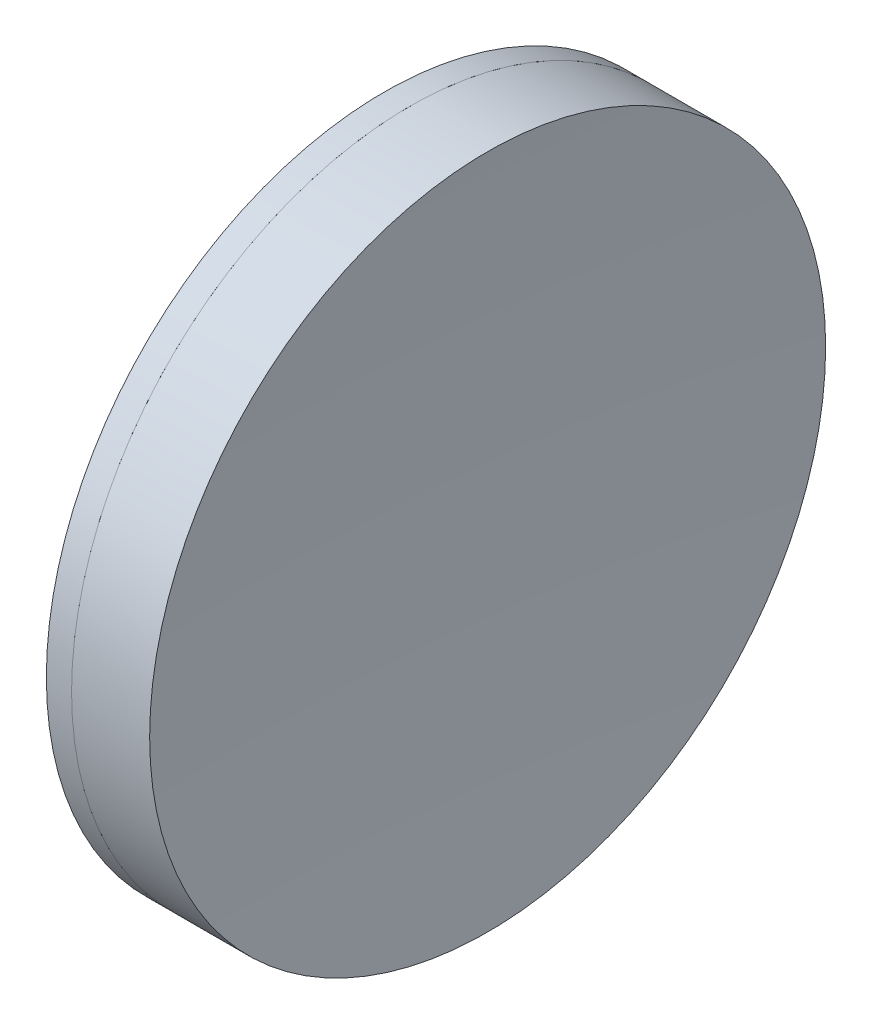
ISO-10303-21;
HEADER;
FILE_DESCRIPTION(('STEP AP214'),'2;1');
FILE_NAME('part.step','',(''),(''),'','','');
FILE_SCHEMA(('AUTOMOTIVE_DESIGN { 1 0 10303 214 1 1 1 1 }'));
ENDSEC;
DATA;
#1=APPLICATION_CONTEXT('core data for automotive mechanical design processes');
#2=APPLICATION_PROTOCOL_DEFINITION('international standard','automotive_design',2000,#1);
#3=PRODUCT_CONTEXT('',#1,'mechanical');
#4=PRODUCT('Part','Part','',(#3));
#5=PRODUCT_RELATED_PRODUCT_CATEGORY('part','',(#4));
#6=PRODUCT_DEFINITION_FORMATION('','',#4);
#7=PRODUCT_DEFINITION_CONTEXT('part definition',#1,'design');
#8=PRODUCT_DEFINITION('design','',#6,#7);
#9=PRODUCT_DEFINITION_SHAPE('','',#8);
#10=(LENGTH_UNIT() NAMED_UNIT(*) SI_UNIT(.MILLI.,.METRE.));
#11=(NAMED_UNIT(*) PLANE_ANGLE_UNIT() SI_UNIT($,.RADIAN.));
#12=(NAMED_UNIT(*) SI_UNIT($,.STERADIAN.) SOLID_ANGLE_UNIT());
#13=UNCERTAINTY_MEASURE_WITH_UNIT(LENGTH_MEASURE(1.E-05),#10,'distance_accuracy_value','');
#14=(GEOMETRIC_REPRESENTATION_CONTEXT(3) GLOBAL_UNCERTAINTY_ASSIGNED_CONTEXT((#13)) GLOBAL_UNIT_ASSIGNED_CONTEXT((#10,
#11,#12)) REPRESENTATION_CONTEXT('',''));
#15=CARTESIAN_POINT('',(0.,0.,0.));
#16=DIRECTION('',(0.,0.,1.));
#17=DIRECTION('',(1.,0.,0.));
#18=AXIS2_PLACEMENT_3D('',#15,#16,#17);
#19=CARTESIAN_POINT('',(44.3647689612468,0.,0.));
#20=DIRECTION('',(-1.,0.,0.));
#21=DIRECTION('',(0.,0.,-1.));
#22=AXIS2_PLACEMENT_3D('',#19,#20,#21);
#23=SPHERICAL_SURFACE('',#22,161.5);
#24=CARTESIAN_POINT('',(203.854862697504,0.,0.));
#25=DIRECTION('',(-1.,0.,0.));
#26=DIRECTION('',(0.,0.,1.));
#27=AXIS2_PLACEMENT_3D('',#24,#25,#26);
#28=CIRCLE('',#27,25.4);
#29=CARTESIAN_POINT('',(203.854862697504,0.,25.4));
#30=VERTEX_POINT('',#29);
#31=EDGE_CURVE('E51',#30,#30,#28,.T.);
#32=ORIENTED_EDGE('',*,*,#31,.T.);
#33=EDGE_LOOP('',(#32));
#34=FACE_BOUND('',#33,.T.);
#35=ADVANCED_FACE('F45',(#34),#23,.F.);
#36=CARTESIAN_POINT('',(585.114768961247,0.,0.));
#37=DIRECTION('',(-1.,0.,0.));
#38=DIRECTION('',(0.,0.,-1.));
#39=AXIS2_PLACEMENT_3D('',#36,#37,#38);
#40=SPHERICAL_SURFACE('',#39,376.25);
#41=CARTESIAN_POINT('',(209.723103497028,0.,0.));
#42=DIRECTION('',(-1.,0.,0.));
#43=DIRECTION('',(0.,0.,1.));
#44=AXIS2_PLACEMENT_3D('',#41,#42,#43);
#45=CIRCLE('',#44,25.4);
#46=CARTESIAN_POINT('',(209.723103497028,0.,25.4));
#47=VERTEX_POINT('',#46);
#48=EDGE_CURVE('E11',#47,#47,#45,.T.);
#49=ORIENTED_EDGE('',*,*,#48,.F.);
#50=EDGE_LOOP('',(#49));
#51=FACE_BOUND('',#50,.T.);
#52=ADVANCED_FACE('F60',(#51),#40,.F.);
#53=CARTESIAN_POINT('',(-0.551919992657797,0.,0.));
#54=DIRECTION('',(-1.,0.,0.));
#55=DIRECTION('',(0.,0.,1.));
#56=AXIS2_PLACEMENT_3D('',#53,#54,#55);
#57=CYLINDRICAL_SURFACE('',#56,25.4);
#58=ORIENTED_EDGE('',*,*,#48,.T.);
#59=EDGE_LOOP('',(#58));
#60=FACE_BOUND('',#59,.T.);
#61=ORIENTED_EDGE('',*,*,#31,.F.);
#62=EDGE_LOOP('',(#61));
#63=FACE_BOUND('',#62,.T.);
#64=ADVANCED_FACE('F58',(#60,#63),#57,.T.);
#65=CLOSED_SHELL('',(#35,#52,#64));
#66=MANIFOLD_SOLID_BREP('B2',#65);
#67=CARTESIAN_POINT('',(324.964768961247,0.,0.));
#68=DIRECTION('',(-1.,0.,0.));
#69=DIRECTION('',(0.,0.,-1.));
#70=AXIS2_PLACEMENT_3D('',#67,#68,#69);
#71=SPHERICAL_SURFACE('',#70,125.6);
#72=CARTESIAN_POINT('',(201.959891009192,0.,0.));
#73=DIRECTION('',(-1.,0.,0.));
#74=DIRECTION('',(0.,0.,1.));
#75=AXIS2_PLACEMENT_3D('',#72,#73,#74);
#76=CIRCLE('',#75,25.4);
#77=CARTESIAN_POINT('',(201.959891009192,0.,25.4));
#78=VERTEX_POINT('',#77);
#79=EDGE_CURVE('E44',#78,#78,#76,.T.);
#80=ORIENTED_EDGE('',*,*,#79,.T.);
#81=EDGE_LOOP('',(#80));
#82=FACE_BOUND('',#81,.T.);
#83=ADVANCED_FACE('F86',(#82),#71,.T.);
#84=CARTESIAN_POINT('',(-0.816062176165804,0.,0.));
#85=DIRECTION('',(-1.,0.,0.));
#86=DIRECTION('',(0.,0.,1.));
#87=AXIS2_PLACEMENT_3D('',#84,#85,#86);
#88=CYLINDRICAL_SURFACE('',#87,25.4);
#89=CARTESIAN_POINT('',(203.854862697504,0.,0.));
#90=DIRECTION('',(-1.,0.,0.));
#91=DIRECTION('',(0.,0.,1.));
#92=AXIS2_PLACEMENT_3D('',#89,#90,#91);
#93=CIRCLE('',#92,25.4);
#94=CARTESIAN_POINT('',(203.854862697504,0.,25.4));
#95=VERTEX_POINT('',#94);
#96=EDGE_CURVE('E92',#95,#95,#93,.T.);
#97=ORIENTED_EDGE('',*,*,#96,.T.);
#98=EDGE_LOOP('',(#97));
#99=FACE_BOUND('',#98,.T.);
#100=ORIENTED_EDGE('',*,*,#79,.F.);
#101=EDGE_LOOP('',(#100));
#102=FACE_BOUND('',#101,.T.);
#103=ADVANCED_FACE('F98',(#99,#102),#88,.T.);
#104=CARTESIAN_POINT('',(44.3647689612468,0.,0.));
#105=DIRECTION('',(-1.,0.,0.));
#106=DIRECTION('',(0.,0.,1.));
#107=AXIS2_PLACEMENT_3D('',#104,#105,#106);
#108=SPHERICAL_SURFACE('',#107,161.5);
#109=ORIENTED_EDGE('',*,*,#96,.F.);
#110=EDGE_LOOP('',(#109));
#111=FACE_BOUND('',#110,.T.);
#112=ADVANCED_FACE('F101',(#111),#108,.T.);
#113=CLOSED_SHELL('',(#83,#103,#112));
#114=MANIFOLD_SOLID_BREP('B6',#113);
#115=ADVANCED_BREP_SHAPE_REPRESENTATION('',(#18,#66,#114),#14);
#116=SHAPE_DEFINITION_REPRESENTATION(#9,#115);
ENDSEC;
END-ISO-10303-21;
